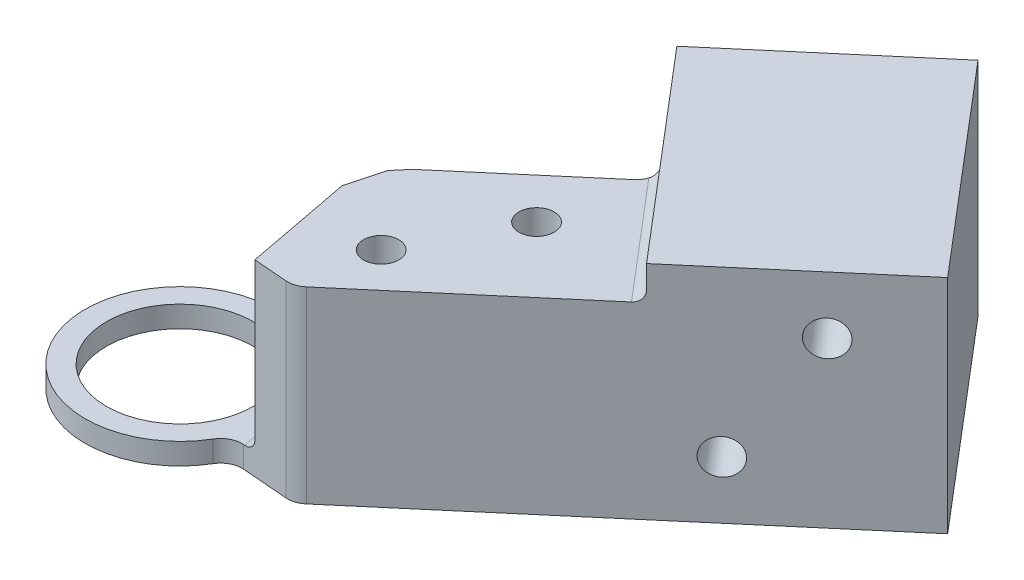
ISO-10303-21;
HEADER;
FILE_DESCRIPTION(('STEP AP214'),'2;1');
FILE_NAME('part.step','',(''),(''),'','','');
FILE_SCHEMA(('AUTOMOTIVE_DESIGN { 1 0 10303 214 1 1 1 1 }'));
ENDSEC;
DATA;
#1=APPLICATION_CONTEXT('core data for automotive mechanical design processes');
#2=APPLICATION_PROTOCOL_DEFINITION('international standard','automotive_design',2000,#1);
#3=PRODUCT_CONTEXT('',#1,'mechanical');
#4=PRODUCT('Part','Part','',(#3));
#5=PRODUCT_RELATED_PRODUCT_CATEGORY('part','',(#4));
#6=PRODUCT_DEFINITION_FORMATION('','',#4);
#7=PRODUCT_DEFINITION_CONTEXT('part definition',#1,'design');
#8=PRODUCT_DEFINITION('design','',#6,#7);
#9=PRODUCT_DEFINITION_SHAPE('','',#8);
#10=(LENGTH_UNIT() NAMED_UNIT(*) SI_UNIT(.MILLI.,.METRE.));
#11=(NAMED_UNIT(*) PLANE_ANGLE_UNIT() SI_UNIT($,.RADIAN.));
#12=(NAMED_UNIT(*) SI_UNIT($,.STERADIAN.) SOLID_ANGLE_UNIT());
#13=UNCERTAINTY_MEASURE_WITH_UNIT(LENGTH_MEASURE(1.E-05),#10,'distance_accuracy_value','');
#14=(GEOMETRIC_REPRESENTATION_CONTEXT(3) GLOBAL_UNCERTAINTY_ASSIGNED_CONTEXT((#13)) GLOBAL_UNIT_ASSIGNED_CONTEXT((#10,
#11,#12)) REPRESENTATION_CONTEXT('',''));
#15=CARTESIAN_POINT('',(0.,0.,0.));
#16=DIRECTION('',(0.,0.,1.));
#17=DIRECTION('',(1.,0.,0.));
#18=AXIS2_PLACEMENT_3D('',#15,#16,#17);
#19=CARTESIAN_POINT('',(0.,17.6,0.));
#20=DIRECTION('',(0.,1.,0.));
#21=DIRECTION('',(0.,0.,1.));
#22=AXIS2_PLACEMENT_3D('',#19,#20,#21);
#23=PLANE('',#22);
#24=DIRECTION('',(-0.99676937750449,0.,-0.0803169226832707));
#25=VECTOR('',#24,1.);
#26=CARTESIAN_POINT('',(8.18209748130973,17.6,3.43786355260721));
#27=LINE('',#26,#25);
#28=CARTESIAN_POINT('',(13.8117147150822,17.6,3.89148255646678));
#29=VERTEX_POINT('',#28);
#30=CARTESIAN_POINT('',(10.6614321873135,17.6,3.63764149360556));
#31=VERTEX_POINT('',#30);
#32=EDGE_CURVE('E193',#29,#31,#27,.T.);
#33=ORIENTED_EDGE('',*,*,#32,.F.);
#34=CARTESIAN_POINT('',(13.9723485604487,17.6,1.8979438014578));
#35=DIRECTION('',(0.,1.,0.));
#36=DIRECTION('',(0.,0.,1.));
#37=AXIS2_PLACEMENT_3D('',#34,#35,#36);
#38=CIRCLE('',#37,2.);
#39=CARTESIAN_POINT('',(15.268408051327,17.6,3.42117385502958));
#40=VERTEX_POINT('',#39);
#41=EDGE_CURVE('E62',#29,#40,#38,.T.);
#42=ORIENTED_EDGE('',*,*,#41,.T.);
#43=DIRECTION('',(0.761615026785892,0.,-0.648029745439146));
#44=VECTOR('',#43,1.);
#45=CARTESIAN_POINT('',(8.10037181798933,17.6,9.52018783482365));
#46=LINE('',#45,#44);
#47=CARTESIAN_POINT('',(31.710437648352,17.6,-10.5687342737899));
#48=VERTEX_POINT('',#47);
#49=EDGE_CURVE('E304',#40,#48,#46,.T.);
#50=ORIENTED_EDGE('',*,*,#49,.T.);
#51=DIRECTION('',(-0.648029745439148,0.,-0.761615026785891));
#52=VECTOR('',#51,1.);
#53=CARTESIAN_POINT('',(22.6380212122039,17.6,-21.2313446487924));
#54=LINE('',#53,#52);
#55=CARTESIAN_POINT('',(22.4643821652422,17.6,-21.4354187801631));
#56=VERTEX_POINT('',#55);
#57=EDGE_CURVE('E322',#48,#56,#54,.T.);
#58=ORIENTED_EDGE('',*,*,#57,.T.);
#59=CARTESIAN_POINT('',(20.5803466945397,17.6,-22.106544956925));
#60=DIRECTION('',(0.,1.,0.));
#61=DIRECTION('',(0.,0.,1.));
#62=AXIS2_PLACEMENT_3D('',#59,#60,#61);
#63=CIRCLE('',#62,2.);
#64=CARTESIAN_POINT('',(21.876406185418,17.6,-20.5833149033532));
#65=VERTEX_POINT('',#64);
#66=EDGE_CURVE('E355',#56,#65,#63,.F.);
#67=ORIENTED_EDGE('',*,*,#66,.T.);
#68=DIRECTION('',(-0.761615026785892,0.,0.648029745439147));
#69=VECTOR('',#68,1.);
#70=CARTESIAN_POINT('',(-0.972044618158711,17.6,-1.14242254017883));
#71=LINE('',#70,#69);
#72=CARTESIAN_POINT('',(10.71766515601,17.6,-11.0887594463461));
#73=VERTEX_POINT('',#72);
#74=EDGE_CURVE('E300',#65,#73,#71,.T.);
#75=ORIENTED_EDGE('',*,*,#74,.T.);
#76=DIRECTION('',(-0.646374370111485,0.,0.763020428077113));
#77=VECTOR('',#76,1.);
#78=CARTESIAN_POINT('',(10.71766515601,17.6,-11.0887594463461));
#79=LINE('',#78,#77);
#80=CARTESIAN_POINT('',(9.64280142211495,17.6,-9.81992357616805));
#81=VERTEX_POINT('',#80);
#82=EDGE_CURVE('E224',#73,#81,#79,.T.);
#83=ORIENTED_EDGE('',*,*,#82,.T.);
#84=DIRECTION('',(0.258089168484607,0.,-0.966121100644699));
#85=VECTOR('',#84,1.);
#86=CARTESIAN_POINT('',(8.02946985117542,17.6,-3.78064001315452));
#87=LINE('',#86,#85);
#88=CARTESIAN_POINT('',(8.73821595766161,17.6,-6.43373302165448));
#89=VERTEX_POINT('',#88);
#90=EDGE_CURVE('E218',#89,#81,#87,.T.);
#91=ORIENTED_EDGE('',*,*,#90,.F.);
#92=DIRECTION('',(-0.187569406552957,0.,-0.982251351602721));
#93=VECTOR('',#92,1.);
#94=CARTESIAN_POINT('',(8.73821595766161,17.6,-6.43373302165448));
#95=LINE('',#94,#93);
#96=EDGE_CURVE('E210',#31,#89,#95,.T.);
#97=ORIENTED_EDGE('',*,*,#96,.F.);
#98=EDGE_LOOP('',(#33,#42,#50,#58,#67,#75,#83,#91,#97));
#99=FACE_BOUND('',#98,.T.);
#100=CARTESIAN_POINT('',(20.7850198838034,17.6,-12.6071628377436));
#101=DIRECTION('',(0.,1.,0.));
#102=DIRECTION('',(0.,0.,1.));
#103=AXIS2_PLACEMENT_3D('',#100,#101,#102);
#104=CIRCLE('',#103,1.64999999999999);
#105=CARTESIAN_POINT('',(20.7850198838034,17.6,-10.9571628377436));
#106=VERTEX_POINT('',#105);
#107=EDGE_CURVE('E237',#106,#106,#104,.T.);
#108=ORIENTED_EDGE('',*,*,#107,.F.);
#109=EDGE_LOOP('',(#108));
#110=FACE_BOUND('',#109,.T.);
#111=CARTESIAN_POINT('',(15.7609885977011,17.6,-3.08040527620853));
#112=DIRECTION('',(0.,1.,0.));
#113=DIRECTION('',(0.,0.,1.));
#114=AXIS2_PLACEMENT_3D('',#111,#112,#113);
#115=CIRCLE('',#114,1.64999999999999);
#116=CARTESIAN_POINT('',(15.7609885977011,17.6,-1.43040527620854));
#117=VERTEX_POINT('',#116);
#118=EDGE_CURVE('E243',#117,#117,#115,.T.);
#119=ORIENTED_EDGE('',*,*,#118,.F.);
#120=EDGE_LOOP('',(#119));
#121=FACE_BOUND('',#120,.T.);
#122=ADVANCED_FACE('F39',(#99,#110,#121),#23,.T.);
#123=CARTESIAN_POINT('',(0.,-33.2,0.));
#124=DIRECTION('',(0.,1.,0.));
#125=DIRECTION('',(0.,0.,1.));
#126=AXIS2_PLACEMENT_3D('',#123,#124,#125);
#127=CYLINDRICAL_SURFACE('',#126,6.875);
#128=CARTESIAN_POINT('',(0.,0.,0.));
#129=DIRECTION('',(0.,1.,0.));
#130=DIRECTION('',(0.,0.,1.));
#131=AXIS2_PLACEMENT_3D('',#128,#129,#130);
#132=CIRCLE('',#131,6.875);
#133=CARTESIAN_POINT('',(0.,0.,6.875));
#134=VERTEX_POINT('',#133);
#135=EDGE_CURVE('E319',#134,#134,#132,.T.);
#136=ORIENTED_EDGE('',*,*,#135,.F.);
#137=EDGE_LOOP('',(#136));
#138=FACE_BOUND('',#137,.T.);
#139=CARTESIAN_POINT('',(0.,2.,0.));
#140=DIRECTION('',(0.,1.,0.));
#141=DIRECTION('',(0.,0.,1.));
#142=AXIS2_PLACEMENT_3D('',#139,#140,#141);
#143=CIRCLE('',#142,6.875);
#144=CARTESIAN_POINT('',(0.,2.,6.875));
#145=VERTEX_POINT('',#144);
#146=EDGE_CURVE('E318',#145,#145,#143,.F.);
#147=ORIENTED_EDGE('',*,*,#146,.F.);
#148=EDGE_LOOP('',(#147));
#149=FACE_BOUND('',#148,.T.);
#150=ADVANCED_FACE('F496',(#138,#149),#127,.F.);
#151=CARTESIAN_POINT('',(0.,0.,0.));
#152=DIRECTION('',(0.,1.,0.));
#153=DIRECTION('',(0.,0.,1.));
#154=AXIS2_PLACEMENT_3D('',#151,#152,#153);
#155=PLANE('',#154);
#156=DIRECTION('',(0.761615026785892,0.,-0.648029745439146));
#157=VECTOR('',#156,1.);
#158=CARTESIAN_POINT('',(8.10037181798933,0.,9.52018783482365));
#159=LINE('',#158,#157);
#160=CARTESIAN_POINT('',(15.268408051327,0.,3.42117385502958));
#161=VERTEX_POINT('',#160);
#162=CARTESIAN_POINT('',(47.7043532108557,0.,-24.177358928012));
#163=VERTEX_POINT('',#162);
#164=EDGE_CURVE('E303',#161,#163,#159,.T.);
#165=ORIENTED_EDGE('',*,*,#164,.F.);
#166=CARTESIAN_POINT('',(13.9723485604487,0.,1.8979438014578));
#167=DIRECTION('',(0.,1.,0.));
#168=DIRECTION('',(0.,0.,1.));
#169=AXIS2_PLACEMENT_3D('',#166,#167,#168);
#170=CIRCLE('',#169,2.);
#171=CARTESIAN_POINT('',(13.8117147150822,0.,3.89148255646678));
#172=VERTEX_POINT('',#171);
#173=EDGE_CURVE('E412',#161,#172,#170,.F.);
#174=ORIENTED_EDGE('',*,*,#173,.T.);
#175=DIRECTION('',(-0.99676937750449,0.,-0.0803169226832707));
#176=VECTOR('',#175,1.);
#177=CARTESIAN_POINT('',(8.18209748130973,0.,3.43786355260721));
#178=LINE('',#177,#176);
#179=CARTESIAN_POINT('',(9.51923909909447,0.,3.54560673007226));
#180=VERTEX_POINT('',#179);
#181=EDGE_CURVE('E202',#172,#180,#178,.T.);
#182=ORIENTED_EDGE('',*,*,#181,.T.);
#183=CARTESIAN_POINT('',(9.35860525372793,0.,5.53914548508124));
#184=DIRECTION('',(0.,1.,0.));
#185=DIRECTION('',(0.,0.,1.));
#186=AXIS2_PLACEMENT_3D('',#183,#184,#185);
#187=CIRCLE('',#186,2.);
#188=CARTESIAN_POINT('',(7.63748244844464,0.,4.52045206253757));
#189=VERTEX_POINT('',#188);
#190=EDGE_CURVE('E12',#180,#189,#187,.T.);
#191=ORIENTED_EDGE('',*,*,#190,.T.);
#192=CARTESIAN_POINT('',(0.,0.,0.));
#193=DIRECTION('',(0.,1.,0.));
#194=DIRECTION('',(0.,0.,1.));
#195=AXIS2_PLACEMENT_3D('',#192,#193,#194);
#196=CIRCLE('',#195,8.875);
#197=CARTESIAN_POINT('',(6.71710964302447,0.,-5.80052265262258));
#198=VERTEX_POINT('',#197);
#199=EDGE_CURVE('E311',#189,#198,#196,.F.);
#200=ORIENTED_EDGE('',*,*,#199,.T.);
#201=CARTESIAN_POINT('',(7.47396706759061,0.,-6.45410266981949));
#202=DIRECTION('',(0.,1.,0.));
#203=DIRECTION('',(0.,0.,1.));
#204=AXIS2_PLACEMENT_3D('',#201,#202,#203);
#205=CIRCLE('',#204,1.);
#206=CARTESIAN_POINT('',(8.04754350394165,0.,-5.6349506255305));
#207=VERTEX_POINT('',#206);
#208=EDGE_CURVE('E339',#198,#207,#205,.T.);
#209=ORIENTED_EDGE('',*,*,#208,.T.);
#210=DIRECTION('',(0.819152044288993,0.,-0.573576436351044));
#211=VECTOR('',#210,1.);
#212=CARTESIAN_POINT('',(0.,0.,0.));
#213=LINE('',#212,#211);
#214=CARTESIAN_POINT('',(8.33615215843007,0.,-5.83703658099585));
#215=VERTEX_POINT('',#214);
#216=EDGE_CURVE('E313',#207,#215,#213,.T.);
#217=ORIENTED_EDGE('',*,*,#216,.T.);
#218=CARTESIAN_POINT('',(7.76257572207902,0.,-6.65618862528484));
#219=DIRECTION('',(0.,1.,0.));
#220=DIRECTION('',(0.,0.,1.));
#221=AXIS2_PLACEMENT_3D('',#218,#219,#220);
#222=CIRCLE('',#221,1.);
#223=CARTESIAN_POINT('',(8.72869682272372,0.,-6.39809945680023));
#224=VERTEX_POINT('',#223);
#225=EDGE_CURVE('E441',#215,#224,#222,.T.);
#226=ORIENTED_EDGE('',*,*,#225,.T.);
#227=DIRECTION('',(-0.258089168484612,0.,0.966121100644697));
#228=VECTOR('',#227,1.);
#229=CARTESIAN_POINT('',(8.63464961695468,0.,-6.04604675159122));
#230=LINE('',#229,#228);
#231=CARTESIAN_POINT('',(9.64280142211495,0.,-9.81992357616805));
#232=VERTEX_POINT('',#231);
#233=EDGE_CURVE('E229',#232,#224,#230,.T.);
#234=ORIENTED_EDGE('',*,*,#233,.F.);
#235=DIRECTION('',(-0.646374370111485,0.,0.763020428077113));
#236=VECTOR('',#235,1.);
#237=CARTESIAN_POINT('',(10.71766515601,0.,-11.0887594463461));
#238=LINE('',#237,#236);
#239=CARTESIAN_POINT('',(10.71766515601,0.,-11.0887594463461));
#240=VERTEX_POINT('',#239);
#241=EDGE_CURVE('E226',#240,#232,#238,.T.);
#242=ORIENTED_EDGE('',*,*,#241,.F.);
#243=DIRECTION('',(-0.761615026785892,0.,0.648029745439147));
#244=VECTOR('',#243,1.);
#245=CARTESIAN_POINT('',(-0.972044618158711,0.,-1.14242254017883));
#246=LINE('',#245,#244);
#247=CARTESIAN_POINT('',(21.876406185418,0.,-20.5833149033532));
#248=VERTEX_POINT('',#247);
#249=EDGE_CURVE('E301',#248,#240,#246,.T.);
#250=ORIENTED_EDGE('',*,*,#249,.F.);
#251=CARTESIAN_POINT('',(20.5803466945397,0.,-22.106544956925));
#252=DIRECTION('',(0.,1.,0.));
#253=DIRECTION('',(0.,0.,1.));
#254=AXIS2_PLACEMENT_3D('',#251,#252,#253);
#255=CIRCLE('',#254,2.);
#256=CARTESIAN_POINT('',(22.1035767481115,0.,-23.4026044478033));
#257=VERTEX_POINT('',#256);
#258=EDGE_CURVE('E445',#248,#257,#255,.T.);
#259=ORIENTED_EDGE('',*,*,#258,.T.);
#260=DIRECTION('',(-0.648029745439148,0.,-0.761615026785891));
#261=VECTOR('',#260,1.);
#262=CARTESIAN_POINT('',(32.4720526751379,0.,-11.2167640192291));
#263=LINE('',#262,#261);
#264=CARTESIAN_POINT('',(16.2713090391592,0.,-30.2571396888764));
#265=VERTEX_POINT('',#264);
#266=EDGE_CURVE('E287',#257,#265,#263,.T.);
#267=ORIENTED_EDGE('',*,*,#266,.T.);
#268=DIRECTION('',(-0.761615026785891,0.,0.648029745439148));
#269=VECTOR('',#268,1.);
#270=CARTESIAN_POINT('',(31.503609574877,0.,-43.2177345976593));
#271=LINE('',#270,#269);
#272=CARTESIAN_POINT('',(31.503609574877,0.,-43.2177345976593));
#273=VERTEX_POINT('',#272);
#274=EDGE_CURVE('E297',#273,#265,#271,.T.);
#275=ORIENTED_EDGE('',*,*,#274,.F.);
#276=DIRECTION('',(-0.648029745439148,0.,-0.761615026785891));
#277=VECTOR('',#276,1.);
#278=CARTESIAN_POINT('',(47.7043532108557,0.,-24.177358928012));
#279=LINE('',#278,#277);
#280=EDGE_CURVE('E277',#163,#273,#279,.T.);
#281=ORIENTED_EDGE('',*,*,#280,.F.);
#282=EDGE_LOOP('',(#165,#174,#182,#191,#200,#209,#217,#226,#234,#242,#250,#259,#267,#275,#281));
#283=FACE_BOUND('',#282,.T.);
#284=ORIENTED_EDGE('',*,*,#135,.T.);
#285=EDGE_LOOP('',(#284));
#286=FACE_BOUND('',#285,.T.);
#287=ADVANCED_FACE('F368',(#283,#286),#155,.F.);
#288=CARTESIAN_POINT('',(0.,2.,0.));
#289=DIRECTION('',(0.,1.,0.));
#290=DIRECTION('',(0.,0.,1.));
#291=AXIS2_PLACEMENT_3D('',#288,#289,#290);
#292=PLANE('',#291);
#293=DIRECTION('',(-0.99676937750449,0.,-0.0803169226832708));
#294=VECTOR('',#293,1.);
#295=CARTESIAN_POINT('',(10.6614321873135,2.,3.63764149360556));
#296=LINE('',#295,#294);
#297=CARTESIAN_POINT('',(9.62745307672707,2.,3.55432631342918));
#298=VERTEX_POINT('',#297);
#299=CARTESIAN_POINT('',(9.51923909909447,2.,3.54560673007226));
#300=VERTEX_POINT('',#299);
#301=EDGE_CURVE('E203',#298,#300,#296,.T.);
#302=ORIENTED_EDGE('',*,*,#301,.F.);
#303=DIRECTION('',(0.187569406552957,0.,0.982251351602721));
#304=VECTOR('',#303,1.);
#305=CARTESIAN_POINT('',(8.63388714767223,2.,-1.64871556133942));
#306=LINE('',#305,#304);
#307=CARTESIAN_POINT('',(7.88991264770524,2.,-5.54471316340153));
#308=VERTEX_POINT('',#307);
#309=EDGE_CURVE('E448',#298,#308,#306,.F.);
#310=ORIENTED_EDGE('',*,*,#309,.T.);
#311=CARTESIAN_POINT('',(7.47396706759061,2.,-6.45410266981949));
#312=DIRECTION('',(0.,1.,0.));
#313=DIRECTION('',(0.,0.,1.));
#314=AXIS2_PLACEMENT_3D('',#311,#312,#313);
#315=CIRCLE('',#314,1.);
#316=CARTESIAN_POINT('',(6.71710964302447,2.,-5.80052265262258));
#317=VERTEX_POINT('',#316);
#318=EDGE_CURVE('E336',#308,#317,#315,.F.);
#319=ORIENTED_EDGE('',*,*,#318,.T.);
#320=CARTESIAN_POINT('',(0.,2.,0.));
#321=DIRECTION('',(0.,1.,0.));
#322=DIRECTION('',(0.,0.,1.));
#323=AXIS2_PLACEMENT_3D('',#320,#321,#322);
#324=CIRCLE('',#323,8.875);
#325=CARTESIAN_POINT('',(7.63748244844464,2.,4.52045206253757));
#326=VERTEX_POINT('',#325);
#327=EDGE_CURVE('E316',#326,#317,#324,.F.);
#328=ORIENTED_EDGE('',*,*,#327,.F.);
#329=CARTESIAN_POINT('',(9.35860525372793,2.,5.53914548508124));
#330=DIRECTION('',(0.,1.,0.));
#331=DIRECTION('',(0.,0.,1.));
#332=AXIS2_PLACEMENT_3D('',#329,#330,#331);
#333=CIRCLE('',#332,2.);
#334=EDGE_CURVE('E47',#326,#300,#333,.F.);
#335=ORIENTED_EDGE('',*,*,#334,.T.);
#336=EDGE_LOOP('',(#302,#310,#319,#328,#335));
#337=FACE_BOUND('',#336,.T.);
#338=ORIENTED_EDGE('',*,*,#146,.T.);
#339=EDGE_LOOP('',(#338));
#340=FACE_BOUND('',#339,.T.);
#341=ADVANCED_FACE('F416',(#337,#340),#292,.T.);
#342=CARTESIAN_POINT('',(0.,0.,0.));
#343=DIRECTION('',(0.573576436351044,0.,0.819152044288993));
#344=DIRECTION('',(0.819152044288993,0.,-0.573576436351044));
#345=AXIS2_PLACEMENT_3D('',#342,#343,#344);
#346=PLANE('',#345);
#347=DIRECTION('',(0.,-1.,0.));
#348=VECTOR('',#347,1.);
#349=CARTESIAN_POINT('',(8.04754350394165,2.,-5.6349506255305));
#350=LINE('',#349,#348);
#351=CARTESIAN_POINT('',(8.04754350394165,2.01486098582819,-5.6349506255305));
#352=VERTEX_POINT('',#351);
#353=EDGE_CURVE('E334',#207,#352,#350,.F.);
#354=ORIENTED_EDGE('',*,*,#353,.T.);
#355=CARTESIAN_POINT('',(7.89330443567853,3.,-5.52695126724622));
#356=DIRECTION('',(0.573576436351044,0.,0.819152044288993));
#357=DIRECTION('',(-0.819152044288993,0.,0.573576436351044));
#358=AXIS2_PLACEMENT_3D('',#355,#356,#357);
#359=ELLIPSE('',#358,1.09625251133259,1.);
#360=CARTESIAN_POINT('',(8.33615215843007,2.130055870185,-5.83703658099585));
#361=VERTEX_POINT('',#360);
#362=EDGE_CURVE('E383',#352,#361,#359,.T.);
#363=ORIENTED_EDGE('',*,*,#362,.T.);
#364=DIRECTION('',(0.,1.,0.));
#365=VECTOR('',#364,1.);
#366=CARTESIAN_POINT('',(8.33615215843007,0.,-5.83703658099585));
#367=LINE('',#366,#365);
#368=EDGE_CURVE('E437',#361,#215,#367,.F.);
#369=ORIENTED_EDGE('',*,*,#368,.T.);
#370=ORIENTED_EDGE('',*,*,#216,.F.);
#371=EDGE_LOOP('',(#354,#363,#369,#370));
#372=FACE_BOUND('',#371,.T.);
#373=ADVANCED_FACE('F435',(#372),#346,.F.);
#374=CARTESIAN_POINT('',(0.,0.,0.));
#375=DIRECTION('',(0.,1.,0.));
#376=DIRECTION('',(0.,0.,1.));
#377=AXIS2_PLACEMENT_3D('',#374,#375,#376);
#378=CYLINDRICAL_SURFACE('',#377,8.875);
#379=ORIENTED_EDGE('',*,*,#199,.F.);
#380=DIRECTION('',(0.,1.,0.));
#381=VECTOR('',#380,1.);
#382=CARTESIAN_POINT('',(7.63748244844464,0.,4.52045206253757));
#383=LINE('',#382,#381);
#384=EDGE_CURVE('E404',#189,#326,#383,.T.);
#385=ORIENTED_EDGE('',*,*,#384,.T.);
#386=ORIENTED_EDGE('',*,*,#327,.T.);
#387=DIRECTION('',(0.,1.,0.));
#388=VECTOR('',#387,1.);
#389=CARTESIAN_POINT('',(6.71710964302447,0.,-5.80052265262258));
#390=LINE('',#389,#388);
#391=EDGE_CURVE('E331',#317,#198,#390,.F.);
#392=ORIENTED_EDGE('',*,*,#391,.T.);
#393=EDGE_LOOP('',(#379,#385,#386,#392));
#394=FACE_BOUND('',#393,.T.);
#395=ADVANCED_FACE('F427',(#394),#378,.T.);
#396=CARTESIAN_POINT('',(-0.972044618158711,0.,-1.14242254017883));
#397=DIRECTION('',(-0.648029745439147,0.,-0.761615026785892));
#398=DIRECTION('',(-0.761615026785892,0.,0.648029745439147));
#399=AXIS2_PLACEMENT_3D('',#396,#397,#398);
#400=PLANE('',#399);
#401=ORIENTED_EDGE('',*,*,#74,.F.);
#402=DIRECTION('',(0.,1.,0.));
#403=VECTOR('',#402,1.);
#404=CARTESIAN_POINT('',(21.876406185418,0.,-20.5833149033532));
#405=LINE('',#404,#403);
#406=EDGE_CURVE('E344',#65,#248,#405,.F.);
#407=ORIENTED_EDGE('',*,*,#406,.T.);
#408=ORIENTED_EDGE('',*,*,#249,.T.);
#409=DIRECTION('',(0.,1.,0.));
#410=VECTOR('',#409,1.);
#411=CARTESIAN_POINT('',(10.71766515601,0.,-11.0887594463461));
#412=LINE('',#411,#410);
#413=EDGE_CURVE('E306',#240,#73,#412,.T.);
#414=ORIENTED_EDGE('',*,*,#413,.T.);
#415=EDGE_LOOP('',(#401,#407,#408,#414));
#416=FACE_BOUND('',#415,.T.);
#417=ADVANCED_FACE('F464',(#416),#400,.T.);
#418=CARTESIAN_POINT('',(8.10037181798933,0.,9.52018783482365));
#419=DIRECTION('',(0.648029745439147,0.,0.761615026785892));
#420=DIRECTION('',(0.761615026785892,0.,-0.648029745439147));
#421=AXIS2_PLACEMENT_3D('',#418,#419,#420);
#422=PLANE('',#421);
#423=ORIENTED_EDGE('',*,*,#49,.F.);
#424=DIRECTION('',(0.,1.,0.));
#425=VECTOR('',#424,1.);
#426=CARTESIAN_POINT('',(15.268408051327,0.,3.42117385502958));
#427=LINE('',#426,#425);
#428=EDGE_CURVE('E54',#40,#161,#427,.F.);
#429=ORIENTED_EDGE('',*,*,#428,.T.);
#430=ORIENTED_EDGE('',*,*,#164,.T.);
#431=DIRECTION('',(0.,-1.,0.));
#432=VECTOR('',#431,1.);
#433=CARTESIAN_POINT('',(47.7043532108557,0.,-24.177358928012));
#434=LINE('',#433,#432);
#435=CARTESIAN_POINT('',(47.7043532108557,20.775,-24.177358928012));
#436=VERTEX_POINT('',#435);
#437=EDGE_CURVE('E274',#436,#163,#434,.T.);
#438=ORIENTED_EDGE('',*,*,#437,.F.);
#439=DIRECTION('',(-0.761615026785891,0.,0.648029745439148));
#440=VECTOR('',#439,1.);
#441=CARTESIAN_POINT('',(47.7043532108557,20.775,-24.177358928012));
#442=LINE('',#441,#440);
#443=CARTESIAN_POINT('',(32.4720526751379,20.775,-11.2167640192291));
#444=VERTEX_POINT('',#443);
#445=EDGE_CURVE('E284',#436,#444,#442,.T.);
#446=ORIENTED_EDGE('',*,*,#445,.T.);
#447=DIRECTION('',(0.,-1.,0.));
#448=VECTOR('',#447,1.);
#449=CARTESIAN_POINT('',(32.4720526751379,0.,-11.2167640192291));
#450=LINE('',#449,#448);
#451=CARTESIAN_POINT('',(32.4720526751379,18.6,-11.2167640192291));
#452=VERTEX_POINT('',#451);
#453=EDGE_CURVE('E273',#444,#452,#450,.T.);
#454=ORIENTED_EDGE('',*,*,#453,.T.);
#455=CARTESIAN_POINT('',(31.710437648352,18.6,-10.5687342737899));
#456=DIRECTION('',(0.648029745439147,0.,0.761615026785892));
#457=DIRECTION('',(0.761615026785892,0.,-0.648029745439147));
#458=AXIS2_PLACEMENT_3D('',#455,#456,#457);
#459=CIRCLE('',#458,1.);
#460=EDGE_CURVE('E328',#452,#48,#459,.F.);
#461=ORIENTED_EDGE('',*,*,#460,.T.);
#462=EDGE_LOOP('',(#423,#429,#430,#438,#446,#454,#461));
#463=FACE_BOUND('',#462,.T.);
#464=CARTESIAN_POINT('',(41.6114329965686,15.3875,-18.9931209644988));
#465=DIRECTION('',(0.648029745439147,0.,0.761615026785892));
#466=DIRECTION('',(0.761615026785892,0.,-0.648029745439147));
#467=AXIS2_PLACEMENT_3D('',#464,#465,#466);
#468=CIRCLE('',#467,1.64999999999999);
#469=CARTESIAN_POINT('',(42.8680977907653,15.3875,-20.0623700444734));
#470=VERTEX_POINT('',#469);
#471=EDGE_CURVE('E249',#470,#470,#468,.T.);
#472=ORIENTED_EDGE('',*,*,#471,.F.);
#473=EDGE_LOOP('',(#472));
#474=FACE_BOUND('',#473,.T.);
#475=CARTESIAN_POINT('',(36.2801278090673,5.38749999999999,-14.4569127464248));
#476=DIRECTION('',(0.648029745439147,0.,0.761615026785892));
#477=DIRECTION('',(0.761615026785892,0.,-0.648029745439147));
#478=AXIS2_PLACEMENT_3D('',#475,#476,#477);
#479=CIRCLE('',#478,1.64999999999999);
#480=CARTESIAN_POINT('',(37.536792603264,5.38749999999999,-15.5261618263994));
#481=VERTEX_POINT('',#480);
#482=EDGE_CURVE('E255',#481,#481,#479,.T.);
#483=ORIENTED_EDGE('',*,*,#482,.F.);
#484=EDGE_LOOP('',(#483));
#485=FACE_BOUND('',#484,.T.);
#486=ADVANCED_FACE('F511',(#463,#474,#485),#422,.T.);
#487=CARTESIAN_POINT('',(24.3716808571485,0.,-20.7369518540527));
#488=DIRECTION('',(-0.761615026785891,0.,0.648029745439148));
#489=DIRECTION('',(0.648029745439148,0.,0.761615026785891));
#490=AXIS2_PLACEMENT_3D('',#487,#488,#489);
#491=PLANE('',#490);
#492=ORIENTED_EDGE('',*,*,#266,.F.);
#493=DIRECTION('',(0.,1.,0.));
#494=VECTOR('',#493,1.);
#495=CARTESIAN_POINT('',(22.1035767481115,18.6,-23.4026044478033));
#496=LINE('',#495,#494);
#497=CARTESIAN_POINT('',(22.1035767481115,18.6,-23.4026044478033));
#498=VERTEX_POINT('',#497);
#499=EDGE_CURVE('E341',#257,#498,#496,.T.);
#500=ORIENTED_EDGE('',*,*,#499,.T.);
#501=DIRECTION('',(-0.648029745439148,0.,-0.761615026785891));
#502=VECTOR('',#501,1.);
#503=CARTESIAN_POINT('',(32.4720526751379,18.6,-11.216764019229));
#504=LINE('',#503,#502);
#505=EDGE_CURVE('E326',#498,#452,#504,.F.);
#506=ORIENTED_EDGE('',*,*,#505,.T.);
#507=ORIENTED_EDGE('',*,*,#453,.F.);
#508=DIRECTION('',(0.648029745439148,0.,0.761615026785891));
#509=VECTOR('',#508,1.);
#510=CARTESIAN_POINT('',(32.4720526751379,20.775,-11.2167640192291));
#511=LINE('',#510,#509);
#512=CARTESIAN_POINT('',(16.2713090391592,20.775,-30.2571396888764));
#513=VERTEX_POINT('',#512);
#514=EDGE_CURVE('E278',#513,#444,#511,.T.);
#515=ORIENTED_EDGE('',*,*,#514,.F.);
#516=DIRECTION('',(0.,1.,0.));
#517=VECTOR('',#516,1.);
#518=CARTESIAN_POINT('',(16.2713090391592,0.,-30.2571396888764));
#519=LINE('',#518,#517);
#520=EDGE_CURVE('E289',#265,#513,#519,.T.);
#521=ORIENTED_EDGE('',*,*,#520,.F.);
#522=EDGE_LOOP('',(#492,#500,#506,#507,#515,#521));
#523=FACE_BOUND('',#522,.T.);
#524=ADVANCED_FACE('F474',(#523),#491,.T.);
#525=CARTESIAN_POINT('',(31.503609574877,0.,-43.2177345976593));
#526=DIRECTION('',(0.648029745439148,0.,0.761615026785891));
#527=DIRECTION('',(0.761615026785891,0.,-0.648029745439148));
#528=AXIS2_PLACEMENT_3D('',#525,#526,#527);
#529=PLANE('',#528);
#530=CARTESIAN_POINT('',(25.4106893605899,15.3875,-38.0334966341461));
#531=DIRECTION('',(-0.648029745439146,0.,-0.761615026785892));
#532=DIRECTION('',(-0.761615026785892,0.,0.648029745439146));
#533=AXIS2_PLACEMENT_3D('',#530,#531,#532);
#534=CIRCLE('',#533,1.64999999999999);
#535=CARTESIAN_POINT('',(24.1540245663932,15.3875,-36.9642475541715));
#536=VERTEX_POINT('',#535);
#537=EDGE_CURVE('E261',#536,#536,#534,.T.);
#538=ORIENTED_EDGE('',*,*,#537,.F.);
#539=EDGE_LOOP('',(#538));
#540=FACE_BOUND('',#539,.T.);
#541=CARTESIAN_POINT('',(20.0793841730887,5.3875,-33.497288416072));
#542=DIRECTION('',(-0.648029745439146,0.,-0.761615026785892));
#543=DIRECTION('',(-0.761615026785892,0.,0.648029745439146));
#544=AXIS2_PLACEMENT_3D('',#541,#542,#543);
#545=CIRCLE('',#544,1.64999999999999);
#546=CARTESIAN_POINT('',(18.822719378892,5.3875,-32.4280393360975));
#547=VERTEX_POINT('',#546);
#548=EDGE_CURVE('E267',#547,#547,#545,.T.);
#549=ORIENTED_EDGE('',*,*,#548,.F.);
#550=EDGE_LOOP('',(#549));
#551=FACE_BOUND('',#550,.T.);
#552=ORIENTED_EDGE('',*,*,#520,.T.);
#553=DIRECTION('',(-0.761615026785891,0.,0.648029745439148));
#554=VECTOR('',#553,1.);
#555=CARTESIAN_POINT('',(31.503609574877,20.775,-43.2177345976593));
#556=LINE('',#555,#554);
#557=CARTESIAN_POINT('',(31.503609574877,20.775,-43.2177345976593));
#558=VERTEX_POINT('',#557);
#559=EDGE_CURVE('E294',#558,#513,#556,.T.);
#560=ORIENTED_EDGE('',*,*,#559,.F.);
#561=DIRECTION('',(0.,1.,0.));
#562=VECTOR('',#561,1.);
#563=CARTESIAN_POINT('',(31.503609574877,0.,-43.2177345976593));
#564=LINE('',#563,#562);
#565=EDGE_CURVE('E280',#273,#558,#564,.T.);
#566=ORIENTED_EDGE('',*,*,#565,.F.);
#567=ORIENTED_EDGE('',*,*,#274,.T.);
#568=EDGE_LOOP('',(#552,#560,#566,#567));
#569=FACE_BOUND('',#568,.T.);
#570=ADVANCED_FACE('F482',(#540,#551,#569),#529,.F.);
#571=CARTESIAN_POINT('',(47.7043532108557,20.775,-24.177358928012));
#572=DIRECTION('',(0.,-1.,0.));
#573=DIRECTION('',(0.,0.,-1.));
#574=AXIS2_PLACEMENT_3D('',#571,#572,#573);
#575=PLANE('',#574);
#576=ORIENTED_EDGE('',*,*,#514,.T.);
#577=ORIENTED_EDGE('',*,*,#445,.F.);
#578=DIRECTION('',(0.648029745439148,0.,0.761615026785891));
#579=VECTOR('',#578,1.);
#580=CARTESIAN_POINT('',(47.7043532108557,20.775,-24.177358928012));
#581=LINE('',#580,#579);
#582=EDGE_CURVE('E282',#558,#436,#581,.T.);
#583=ORIENTED_EDGE('',*,*,#582,.F.);
#584=ORIENTED_EDGE('',*,*,#559,.T.);
#585=EDGE_LOOP('',(#576,#577,#583,#584));
#586=FACE_BOUND('',#585,.T.);
#587=ADVANCED_FACE('F516',(#586),#575,.F.);
#588=CARTESIAN_POINT('',(39.6039813928663,0.,-33.6975467628357));
#589=DIRECTION('',(-0.761615026785891,0.,0.648029745439148));
#590=DIRECTION('',(0.648029745439148,0.,0.761615026785891));
#591=AXIS2_PLACEMENT_3D('',#588,#589,#590);
#592=PLANE('',#591);
#593=ORIENTED_EDGE('',*,*,#437,.T.);
#594=ORIENTED_EDGE('',*,*,#280,.T.);
#595=ORIENTED_EDGE('',*,*,#565,.T.);
#596=ORIENTED_EDGE('',*,*,#582,.T.);
#597=EDGE_LOOP('',(#593,#594,#595,#596));
#598=FACE_BOUND('',#597,.T.);
#599=ADVANCED_FACE('F486',(#598),#592,.F.);
#600=CARTESIAN_POINT('',(24.6155923911627,5.3875,-28.1659832285708));
#601=DIRECTION('',(-0.648029745439146,0.,-0.761615026785892));
#602=DIRECTION('',(-0.761615026785892,0.,0.648029745439146));
#603=AXIS2_PLACEMENT_3D('',#600,#601,#602);
#604=CONICAL_SURFACE('',#603,1.65,1.02974425867665);
#605=CARTESIAN_POINT('',(25.2580620552509,5.3875,-27.4109028424196));
#606=VERTEX_POINT('',#605);
#607=VERTEX_LOOP('',#606);
#608=FACE_BOUND('',#607,.T.);
#609=CARTESIAN_POINT('',(24.6155923911627,5.3875,-28.1659832285708));
#610=DIRECTION('',(-0.648029745439146,0.,-0.761615026785892));
#611=DIRECTION('',(-0.761615026785892,0.,0.648029745439146));
#612=AXIS2_PLACEMENT_3D('',#609,#610,#611);
#613=CIRCLE('',#612,1.65);
#614=CARTESIAN_POINT('',(23.358927596966,5.3875,-27.0967341485962));
#615=VERTEX_POINT('',#614);
#616=EDGE_CURVE('E270',#615,#615,#613,.T.);
#617=ORIENTED_EDGE('',*,*,#616,.T.);
#618=EDGE_LOOP('',(#617));
#619=FACE_BOUND('',#618,.T.);
#620=ADVANCED_FACE('F525',(#608,#619),#604,.F.);
#621=CARTESIAN_POINT('',(20.0793841730887,5.3875,-33.497288416072));
#622=DIRECTION('',(-0.648029745439146,0.,-0.761615026785892));
#623=DIRECTION('',(-0.761615026785892,0.,0.648029745439146));
#624=AXIS2_PLACEMENT_3D('',#621,#622,#623);
#625=CYLINDRICAL_SURFACE('',#624,1.64999999999999);
#626=ORIENTED_EDGE('',*,*,#616,.F.);
#627=EDGE_LOOP('',(#626));
#628=FACE_BOUND('',#627,.T.);
#629=ORIENTED_EDGE('',*,*,#548,.T.);
#630=EDGE_LOOP('',(#629));
#631=FACE_BOUND('',#630,.T.);
#632=ADVANCED_FACE('F528',(#628,#631),#625,.F.);
#633=CARTESIAN_POINT('',(29.9468975786639,15.3875,-32.7021914466448));
#634=DIRECTION('',(-0.648029745439146,0.,-0.761615026785892));
#635=DIRECTION('',(-0.761615026785892,0.,0.648029745439146));
#636=AXIS2_PLACEMENT_3D('',#633,#634,#635);
#637=CONICAL_SURFACE('',#636,1.65,1.02974425867665);
#638=CARTESIAN_POINT('',(30.5893672427521,15.3875,-31.9471110604936));
#639=VERTEX_POINT('',#638);
#640=VERTEX_LOOP('',#639);
#641=FACE_BOUND('',#640,.T.);
#642=CARTESIAN_POINT('',(29.9468975786639,15.3875,-32.7021914466448));
#643=DIRECTION('',(-0.648029745439146,0.,-0.761615026785892));
#644=DIRECTION('',(-0.761615026785892,0.,0.648029745439146));
#645=AXIS2_PLACEMENT_3D('',#642,#643,#644);
#646=CIRCLE('',#645,1.65);
#647=CARTESIAN_POINT('',(28.6902327844672,15.3875,-31.6329423666702));
#648=VERTEX_POINT('',#647);
#649=EDGE_CURVE('E264',#648,#648,#646,.T.);
#650=ORIENTED_EDGE('',*,*,#649,.T.);
#651=EDGE_LOOP('',(#650));
#652=FACE_BOUND('',#651,.T.);
#653=ADVANCED_FACE('F532',(#641,#652),#637,.F.);
#654=CARTESIAN_POINT('',(25.4106893605899,15.3875,-38.0334966341461));
#655=DIRECTION('',(-0.648029745439146,0.,-0.761615026785892));
#656=DIRECTION('',(-0.761615026785892,0.,0.648029745439146));
#657=AXIS2_PLACEMENT_3D('',#654,#655,#656);
#658=CYLINDRICAL_SURFACE('',#657,1.64999999999999);
#659=ORIENTED_EDGE('',*,*,#649,.F.);
#660=EDGE_LOOP('',(#659));
#661=FACE_BOUND('',#660,.T.);
#662=ORIENTED_EDGE('',*,*,#537,.T.);
#663=EDGE_LOOP('',(#662));
#664=FACE_BOUND('',#663,.T.);
#665=ADVANCED_FACE('F536',(#661,#664),#658,.F.);
#666=CARTESIAN_POINT('',(31.7439195909933,5.38749999999999,-19.788217933926));
#667=DIRECTION('',(0.648029745439147,0.,0.761615026785892));
#668=DIRECTION('',(0.761615026785892,0.,-0.648029745439147));
#669=AXIS2_PLACEMENT_3D('',#666,#667,#668);
#670=CONICAL_SURFACE('',#669,1.65,1.02974425867666);
#671=CARTESIAN_POINT('',(31.1014499269051,5.38749999999999,-20.5432983200772));
#672=VERTEX_POINT('',#671);
#673=VERTEX_LOOP('',#672);
#674=FACE_BOUND('',#673,.T.);
#675=CARTESIAN_POINT('',(31.7439195909933,5.38749999999999,-19.788217933926));
#676=DIRECTION('',(0.648029745439147,0.,0.761615026785892));
#677=DIRECTION('',(0.761615026785892,0.,-0.648029745439147));
#678=AXIS2_PLACEMENT_3D('',#675,#676,#677);
#679=CIRCLE('',#678,1.65);
#680=CARTESIAN_POINT('',(33.00058438519,5.38749999999999,-20.8574670139006));
#681=VERTEX_POINT('',#680);
#682=EDGE_CURVE('E258',#681,#681,#679,.T.);
#683=ORIENTED_EDGE('',*,*,#682,.T.);
#684=EDGE_LOOP('',(#683));
#685=FACE_BOUND('',#684,.T.);
#686=ADVANCED_FACE('F540',(#674,#685),#670,.F.);
#687=CARTESIAN_POINT('',(36.2801278090673,5.38749999999999,-14.4569127464248));
#688=DIRECTION('',(0.648029745439147,0.,0.761615026785892));
#689=DIRECTION('',(0.761615026785892,0.,-0.648029745439147));
#690=AXIS2_PLACEMENT_3D('',#687,#688,#689);
#691=CYLINDRICAL_SURFACE('',#690,1.64999999999999);
#692=ORIENTED_EDGE('',*,*,#682,.F.);
#693=EDGE_LOOP('',(#692));
#694=FACE_BOUND('',#693,.T.);
#695=ORIENTED_EDGE('',*,*,#482,.T.);
#696=EDGE_LOOP('',(#695));
#697=FACE_BOUND('',#696,.T.);
#698=ADVANCED_FACE('F544',(#694,#697),#691,.F.);
#699=CARTESIAN_POINT('',(37.0752247784945,15.3875,-24.3244261520001));
#700=DIRECTION('',(0.648029745439147,0.,0.761615026785892));
#701=DIRECTION('',(0.761615026785892,0.,-0.648029745439147));
#702=AXIS2_PLACEMENT_3D('',#699,#700,#701);
#703=CONICAL_SURFACE('',#702,1.65,1.02974425867665);
#704=CARTESIAN_POINT('',(36.4327551144063,15.3875,-25.0795065381512));
#705=VERTEX_POINT('',#704);
#706=VERTEX_LOOP('',#705);
#707=FACE_BOUND('',#706,.T.);
#708=CARTESIAN_POINT('',(37.0752247784945,15.3875,-24.3244261520001));
#709=DIRECTION('',(0.648029745439147,0.,0.761615026785892));
#710=DIRECTION('',(0.761615026785892,0.,-0.648029745439147));
#711=AXIS2_PLACEMENT_3D('',#708,#709,#710);
#712=CIRCLE('',#711,1.65);
#713=CARTESIAN_POINT('',(38.3318895726912,15.3875,-25.3936752319746));
#714=VERTEX_POINT('',#713);
#715=EDGE_CURVE('E252',#714,#714,#712,.T.);
#716=ORIENTED_EDGE('',*,*,#715,.T.);
#717=EDGE_LOOP('',(#716));
#718=FACE_BOUND('',#717,.T.);
#719=ADVANCED_FACE('F548',(#707,#718),#703,.F.);
#720=CARTESIAN_POINT('',(41.6114329965686,15.3875,-18.9931209644988));
#721=DIRECTION('',(0.648029745439147,0.,0.761615026785892));
#722=DIRECTION('',(0.761615026785892,0.,-0.648029745439147));
#723=AXIS2_PLACEMENT_3D('',#720,#721,#722);
#724=CYLINDRICAL_SURFACE('',#723,1.64999999999999);
#725=ORIENTED_EDGE('',*,*,#715,.F.);
#726=EDGE_LOOP('',(#725));
#727=FACE_BOUND('',#726,.T.);
#728=ORIENTED_EDGE('',*,*,#471,.T.);
#729=EDGE_LOOP('',(#728));
#730=FACE_BOUND('',#729,.T.);
#731=ADVANCED_FACE('F552',(#727,#730),#724,.F.);
#732=CARTESIAN_POINT('',(15.7609885977011,10.6,-3.08040527620853));
#733=DIRECTION('',(0.,1.,0.));
#734=DIRECTION('',(0.,0.,1.));
#735=AXIS2_PLACEMENT_3D('',#732,#733,#734);
#736=CONICAL_SURFACE('',#735,1.65,1.02974425867665);
#737=CARTESIAN_POINT('',(15.7609885977011,9.60857997860453,-3.08040527620853));
#738=VERTEX_POINT('',#737);
#739=VERTEX_LOOP('',#738);
#740=FACE_BOUND('',#739,.T.);
#741=CARTESIAN_POINT('',(15.7609885977011,10.6,-3.08040527620853));
#742=DIRECTION('',(0.,1.,0.));
#743=DIRECTION('',(0.,0.,1.));
#744=AXIS2_PLACEMENT_3D('',#741,#742,#743);
#745=CIRCLE('',#744,1.65);
#746=CARTESIAN_POINT('',(15.7609885977011,10.6,-1.43040527620853));
#747=VERTEX_POINT('',#746);
#748=EDGE_CURVE('E246',#747,#747,#745,.T.);
#749=ORIENTED_EDGE('',*,*,#748,.T.);
#750=EDGE_LOOP('',(#749));
#751=FACE_BOUND('',#750,.T.);
#752=ADVANCED_FACE('F556',(#740,#751),#736,.F.);
#753=CARTESIAN_POINT('',(15.7609885977011,17.6,-3.08040527620853));
#754=DIRECTION('',(0.,1.,0.));
#755=DIRECTION('',(0.,0.,1.));
#756=AXIS2_PLACEMENT_3D('',#753,#754,#755);
#757=CYLINDRICAL_SURFACE('',#756,1.65);
#758=ORIENTED_EDGE('',*,*,#748,.F.);
#759=EDGE_LOOP('',(#758));
#760=FACE_BOUND('',#759,.T.);
#761=ORIENTED_EDGE('',*,*,#118,.T.);
#762=EDGE_LOOP('',(#761));
#763=FACE_BOUND('',#762,.T.);
#764=ADVANCED_FACE('F560',(#760,#763),#757,.F.);
#765=CARTESIAN_POINT('',(20.7850198838034,10.6,-12.6071628377436));
#766=DIRECTION('',(0.,1.,0.));
#767=DIRECTION('',(0.,0.,1.));
#768=AXIS2_PLACEMENT_3D('',#765,#766,#767);
#769=CONICAL_SURFACE('',#768,1.65,1.02974425867665);
#770=CARTESIAN_POINT('',(20.7850198838034,9.60857997860453,-12.6071628377436));
#771=VERTEX_POINT('',#770);
#772=VERTEX_LOOP('',#771);
#773=FACE_BOUND('',#772,.T.);
#774=CARTESIAN_POINT('',(20.7850198838034,10.6,-12.6071628377436));
#775=DIRECTION('',(0.,1.,0.));
#776=DIRECTION('',(0.,0.,1.));
#777=AXIS2_PLACEMENT_3D('',#774,#775,#776);
#778=CIRCLE('',#777,1.65);
#779=CARTESIAN_POINT('',(20.7850198838034,10.6,-10.9571628377436));
#780=VERTEX_POINT('',#779);
#781=EDGE_CURVE('E240',#780,#780,#778,.T.);
#782=ORIENTED_EDGE('',*,*,#781,.T.);
#783=EDGE_LOOP('',(#782));
#784=FACE_BOUND('',#783,.T.);
#785=ADVANCED_FACE('F564',(#773,#784),#769,.F.);
#786=CARTESIAN_POINT('',(20.7850198838034,17.6,-12.6071628377436));
#787=DIRECTION('',(0.,1.,0.));
#788=DIRECTION('',(0.,0.,1.));
#789=AXIS2_PLACEMENT_3D('',#786,#787,#788);
#790=CYLINDRICAL_SURFACE('',#789,1.64999999999999);
#791=ORIENTED_EDGE('',*,*,#781,.F.);
#792=EDGE_LOOP('',(#791));
#793=FACE_BOUND('',#792,.T.);
#794=ORIENTED_EDGE('',*,*,#107,.T.);
#795=EDGE_LOOP('',(#794));
#796=FACE_BOUND('',#795,.T.);
#797=ADVANCED_FACE('F366',(#793,#796),#790,.F.);
#798=CARTESIAN_POINT('',(23.6100658303626,18.6,-20.0889221086136));
#799=DIRECTION('',(0.648029745439148,0.,0.761615026785891));
#800=DIRECTION('',(0.761615026785891,0.,-0.648029745439148));
#801=AXIS2_PLACEMENT_3D('',#798,#799,#800);
#802=CYLINDRICAL_SURFACE('',#801,1.);
#803=ORIENTED_EDGE('',*,*,#460,.F.);
#804=ORIENTED_EDGE('',*,*,#505,.F.);
#805=CARTESIAN_POINT('',(22.4643821652422,17.6,-21.4354187801631));
#806=CARTESIAN_POINT('',(22.4789067108878,17.5999998056884,-21.4761537116862));
#807=CARTESIAN_POINT('',(22.4920684607521,17.602103197962,-21.5173201481635));
#808=CARTESIAN_POINT('',(22.5156051969201,17.6100134076426,-21.5999856181927));
#809=CARTESIAN_POINT('',(22.52598715061,17.6158108403891,-21.6414835465486));
#810=CARTESIAN_POINT('',(22.5438577607726,17.6305123591962,-21.723942182586));
#811=CARTESIAN_POINT('',(22.5513829262915,17.6393742698425,-21.7649027239194));
#812=CARTESIAN_POINT('',(22.5638082144595,17.6597852158221,-21.846566433192));
#813=CARTESIAN_POINT('',(22.568706393757,17.6713362314266,-21.8872693886431));
#814=CARTESIAN_POINT('',(22.5809729498892,17.7142327675106,-22.0239732827775));
#815=CARTESIAN_POINT('',(22.5824445752691,17.7509215034251,-22.1188866660507));
#816=CARTESIAN_POINT('',(22.5727179203614,17.8331876683941,-22.304482331464));
#817=CARTESIAN_POINT('',(22.5614428475283,17.8788175882158,-22.3951355050126));
#818=CARTESIAN_POINT('',(22.5208823912814,17.9956654044556,-22.6066980698438));
#819=CARTESIAN_POINT('',(22.4861492428627,18.0697581556716,-22.7249773190207));
#820=CARTESIAN_POINT('',(22.39802732187,18.2239793949534,-22.9495067952112));
#821=CARTESIAN_POINT('',(22.3446627919287,18.3040999340624,-23.0557724173043));
#822=CARTESIAN_POINT('',(22.2306031522248,18.4546835611495,-23.240828002803));
#823=CARTESIAN_POINT('',(22.1722250153233,18.5247822523478,-23.321345141413));
#824=CARTESIAN_POINT('',(22.1067283540327,18.5965573838849,-23.3988935694775));
#825=CARTESIAN_POINT('',(22.1051542225523,18.5982787128306,-23.4007504689837));
#826=CARTESIAN_POINT('',(22.1035767481115,18.6,-23.4026044478033));
#827=B_SPLINE_CURVE_WITH_KNOTS('',3,(#805,#806,#807,#808,#809,#810,#811,#812,#813,#814,#815,
#816,#817,#818,#819,#820,#821,#822,#823,#824,#825,#826),.UNSPECIFIED.,.F.,.F.,(4,2,2,2,2,2,2,2,
2,2,4),(0.,0.129592295294571,0.25885666865275,0.3864085092684,0.514054578529991,
0.817592410147237,1.1229686971365,1.55212503753217,1.98072504008938,2.34472916750578,
2.35367344935465),.UNSPECIFIED.);
#828=EDGE_CURVE('E346',#498,#56,#827,.F.);
#829=ORIENTED_EDGE('',*,*,#828,.T.);
#830=ORIENTED_EDGE('',*,*,#57,.F.);
#831=EDGE_LOOP('',(#803,#804,#829,#830));
#832=FACE_BOUND('',#831,.T.);
#833=ADVANCED_FACE('F361',(#832),#802,.F.);
#834=CARTESIAN_POINT('',(7.47396706759061,0.,-6.45410266981949));
#835=DIRECTION('',(0.,1.,0.));
#836=DIRECTION('',(0.,0.,1.));
#837=AXIS2_PLACEMENT_3D('',#834,#835,#836);
#838=CYLINDRICAL_SURFACE('',#837,1.);
#839=ORIENTED_EDGE('',*,*,#208,.F.);
#840=ORIENTED_EDGE('',*,*,#391,.F.);
#841=ORIENTED_EDGE('',*,*,#318,.F.);
#842=CARTESIAN_POINT('',(7.88991264770524,2.,-5.54471316340153));
#843=CARTESIAN_POINT('',(7.9037830457165,1.99999907890525,-5.55105623588139));
#844=CARTESIAN_POINT('',(7.91750623286512,2.00032915821,-5.55771787282783));
#845=CARTESIAN_POINT('',(7.94456195045137,2.0016196847325,-5.57162295572427));
#846=CARTESIAN_POINT('',(7.95789570976843,2.00257785755054,-5.57886422003338));
#847=CARTESIAN_POINT('',(7.98417630824493,2.00509330266324,-5.59391901823876));
#848=CARTESIAN_POINT('',(7.99712316525577,2.006650547271,-5.60173252567457));
#849=CARTESIAN_POINT('',(8.02263952988388,2.0103354681127,-5.61792801334406));
#850=CARTESIAN_POINT('',(8.03520750449179,2.01246518574899,-5.62631194617086));
#851=CARTESIAN_POINT('',(8.04754350394179,2.01486098582778,-5.63495062553021));
#852=B_SPLINE_CURVE_WITH_KNOTS('',3,(#842,#843,#844,#845,#846,#847,#848,#849,#850,#851),
.UNSPECIFIED.,.F.,.F.,(4,2,2,2,4),(0.,0.0457463120410043,0.0913278797081288,0.136907341016197,
0.182651542932485),.UNSPECIFIED.);
#853=EDGE_CURVE('E374',#308,#352,#852,.T.);
#854=ORIENTED_EDGE('',*,*,#853,.T.);
#855=ORIENTED_EDGE('',*,*,#353,.F.);
#856=EDGE_LOOP('',(#839,#840,#841,#854,#855));
#857=FACE_BOUND('',#856,.T.);
#858=ADVANCED_FACE('F365',(#857),#838,.F.);
#859=CARTESIAN_POINT('',(20.5803466945397,0.,-22.106544956925));
#860=DIRECTION('',(0.,-1.,0.));
#861=DIRECTION('',(0.,0.,-1.));
#862=AXIS2_PLACEMENT_3D('',#859,#860,#861);
#863=CYLINDRICAL_SURFACE('',#862,2.);
#864=ORIENTED_EDGE('',*,*,#258,.F.);
#865=ORIENTED_EDGE('',*,*,#406,.F.);
#866=ORIENTED_EDGE('',*,*,#66,.F.);
#867=ORIENTED_EDGE('',*,*,#828,.F.);
#868=ORIENTED_EDGE('',*,*,#499,.F.);
#869=EDGE_LOOP('',(#864,#865,#866,#867,#868));
#870=FACE_BOUND('',#869,.T.);
#871=ADVANCED_FACE('F357',(#870),#863,.F.);
#872=CARTESIAN_POINT('',(8.02946985117542,-11.6005472921728,-3.78064001315452));
#873=DIRECTION('',(0.966121100644699,0.,0.258089168484607));
#874=DIRECTION('',(0.258089168484607,0.,-0.966121100644699));
#875=AXIS2_PLACEMENT_3D('',#872,#873,#874);
#876=PLANE('',#875);
#877=ORIENTED_EDGE('',*,*,#233,.T.);
#878=DIRECTION('',(0.,1.,0.));
#879=VECTOR('',#878,1.);
#880=CARTESIAN_POINT('',(8.72869682272372,2.,-6.39809945680023));
#881=LINE('',#880,#879);
#882=CARTESIAN_POINT('',(8.72869682272372,2.82164414223656,-6.39809945680023));
#883=VERTEX_POINT('',#882);
#884=EDGE_CURVE('E442',#224,#883,#881,.T.);
#885=ORIENTED_EDGE('',*,*,#884,.T.);
#886=CARTESIAN_POINT('',(8.14452974351583,3.,-4.21135080385013));
#887=DIRECTION('',(0.966121100644699,0.,0.258089168484607));
#888=DIRECTION('',(-0.258089168484607,0.,0.966121100644699));
#889=AXIS2_PLACEMENT_3D('',#886,#887,#888);
#890=ELLIPSE('',#889,2.30031433566801,1.);
#891=CARTESIAN_POINT('',(8.73821595766161,3.,-6.43373302165448));
#892=VERTEX_POINT('',#891);
#893=EDGE_CURVE('E402',#883,#892,#890,.T.);
#894=ORIENTED_EDGE('',*,*,#893,.T.);
#895=DIRECTION('',(0.,1.,0.));
#896=VECTOR('',#895,1.);
#897=CARTESIAN_POINT('',(8.73821595766161,-8.42962326685258,-6.43373302165448));
#898=LINE('',#897,#896);
#899=EDGE_CURVE('E214',#892,#89,#898,.T.);
#900=ORIENTED_EDGE('',*,*,#899,.T.);
#901=ORIENTED_EDGE('',*,*,#90,.T.);
#902=DIRECTION('',(0.,1.,0.));
#903=VECTOR('',#902,1.);
#904=CARTESIAN_POINT('',(9.64280142211495,0.,-9.81992357616805));
#905=LINE('',#904,#903);
#906=EDGE_CURVE('E232',#232,#81,#905,.T.);
#907=ORIENTED_EDGE('',*,*,#906,.F.);
#908=EDGE_LOOP('',(#877,#885,#894,#900,#901,#907));
#909=FACE_BOUND('',#908,.T.);
#910=ADVANCED_FACE('F453',(#909),#876,.F.);
#911=CARTESIAN_POINT('',(10.71766515601,0.,-11.0887594463461));
#912=DIRECTION('',(-0.763020428077113,0.,-0.646374370111485));
#913=DIRECTION('',(-0.646374370111485,0.,0.763020428077113));
#914=AXIS2_PLACEMENT_3D('',#911,#912,#913);
#915=PLANE('',#914);
#916=ORIENTED_EDGE('',*,*,#82,.F.);
#917=ORIENTED_EDGE('',*,*,#413,.F.);
#918=ORIENTED_EDGE('',*,*,#241,.T.);
#919=ORIENTED_EDGE('',*,*,#906,.T.);
#920=EDGE_LOOP('',(#916,#917,#918,#919));
#921=FACE_BOUND('',#920,.T.);
#922=ADVANCED_FACE('F461',(#921),#915,.T.);
#923=CARTESIAN_POINT('',(8.18209748130973,0.,3.43786355260721));
#924=DIRECTION('',(0.0803169226832707,0.,-0.99676937750449));
#925=DIRECTION('',(-0.99676937750449,0.,-0.0803169226832707));
#926=AXIS2_PLACEMENT_3D('',#923,#924,#925);
#927=PLANE('',#926);
#928=ORIENTED_EDGE('',*,*,#301,.T.);
#929=DIRECTION('',(0.,-1.,0.));
#930=VECTOR('',#929,1.);
#931=CARTESIAN_POINT('',(9.51923909909447,0.,3.54560673007226));
#932=LINE('',#931,#930);
#933=EDGE_CURVE('E408',#300,#180,#932,.T.);
#934=ORIENTED_EDGE('',*,*,#933,.T.);
#935=ORIENTED_EDGE('',*,*,#181,.F.);
#936=DIRECTION('',(0.,1.,0.));
#937=VECTOR('',#936,1.);
#938=CARTESIAN_POINT('',(13.8117147150822,17.6,3.89148255646678));
#939=LINE('',#938,#937);
#940=EDGE_CURVE('E200',#172,#29,#939,.T.);
#941=ORIENTED_EDGE('',*,*,#940,.T.);
#942=ORIENTED_EDGE('',*,*,#32,.T.);
#943=DIRECTION('',(0.,1.,0.));
#944=VECTOR('',#943,1.);
#945=CARTESIAN_POINT('',(10.6614321873135,-8.42962326685258,3.63764149360556));
#946=LINE('',#945,#944);
#947=CARTESIAN_POINT('',(10.6614321873135,3.,3.63764149360556));
#948=VERTEX_POINT('',#947);
#949=EDGE_CURVE('E197',#948,#31,#946,.T.);
#950=ORIENTED_EDGE('',*,*,#949,.F.);
#951=CARTESIAN_POINT('',(9.62745307672707,3.,3.55432631342918));
#952=DIRECTION('',(0.0803169226832707,0.,-0.99676937750449));
#953=DIRECTION('',(0.99676937750449,0.,0.0803169226832707));
#954=AXIS2_PLACEMENT_3D('',#951,#952,#953);
#955=ELLIPSE('',#954,1.03733033329649,1.);
#956=EDGE_CURVE('E384',#948,#298,#955,.T.);
#957=ORIENTED_EDGE('',*,*,#956,.T.);
#958=EDGE_LOOP('',(#928,#934,#935,#941,#942,#950,#957));
#959=FACE_BOUND('',#958,.T.);
#960=ADVANCED_FACE('F196',(#959),#927,.F.);
#961=CARTESIAN_POINT('',(8.73821595766161,-8.42962326685258,-6.43373302165448));
#962=DIRECTION('',(0.982251351602721,0.,-0.187569406552957));
#963=DIRECTION('',(-0.187569406552957,0.,-0.982251351602721));
#964=AXIS2_PLACEMENT_3D('',#961,#962,#963);
#965=PLANE('',#964);
#966=ORIENTED_EDGE('',*,*,#899,.F.);
#967=DIRECTION('',(0.187569406552957,0.,0.982251351602721));
#968=VECTOR('',#967,1.);
#969=CARTESIAN_POINT('',(8.73821595766161,3.,-6.43373302165448));
#970=LINE('',#969,#968);
#971=EDGE_CURVE('E213',#892,#948,#970,.T.);
#972=ORIENTED_EDGE('',*,*,#971,.T.);
#973=ORIENTED_EDGE('',*,*,#949,.T.);
#974=ORIENTED_EDGE('',*,*,#96,.T.);
#975=EDGE_LOOP('',(#966,#972,#973,#974));
#976=FACE_BOUND('',#975,.T.);
#977=ADVANCED_FACE('F209',(#976),#965,.F.);
#978=CARTESIAN_POINT('',(7.76257572207902,-11.6005472921728,-6.65618862528484));
#979=DIRECTION('',(0.,-1.,0.));
#980=DIRECTION('',(0.,0.,-1.));
#981=AXIS2_PLACEMENT_3D('',#978,#979,#980);
#982=CYLINDRICAL_SURFACE('',#981,1.);
#983=ORIENTED_EDGE('',*,*,#225,.F.);
#984=ORIENTED_EDGE('',*,*,#368,.F.);
#985=CARTESIAN_POINT('',(8.33615215843007,2.130055870185,-5.83703658099585));
#986=CARTESIAN_POINT('',(8.35990949219744,2.14505621022833,-5.85367369179542));
#987=CARTESIAN_POINT('',(8.38248142570685,2.16105980498195,-5.87101682657403));
#988=CARTESIAN_POINT('',(8.42526779873132,2.19481659807734,-5.90677809181801));
#989=CARTESIAN_POINT('',(8.44548621783383,2.21256674650388,-5.92519432622547));
#990=CARTESIAN_POINT('',(8.50266439683257,2.26805567039927,-5.98155734487955));
#991=CARTESIAN_POINT('',(8.53624923556739,2.30809971459079,-6.02069296900226));
#992=CARTESIAN_POINT('',(8.59478405967422,2.39273119454158,-6.09956702551091));
#993=CARTESIAN_POINT('',(8.6197923680797,2.43728516131041,-6.13929938743001));
#994=CARTESIAN_POINT('',(8.66224937396636,2.53084271480184,-6.21739143509388));
#995=CARTESIAN_POINT('',(8.67971237767425,2.57983766583362,-6.25575359093006));
#996=CARTESIAN_POINT('',(8.70175826832584,2.66112469786622,-6.31207229188226));
#997=CARTESIAN_POINT('',(8.70865449082484,2.69158550080013,-6.33173263397101));
#998=CARTESIAN_POINT('',(8.7202843664913,2.75479131660977,-6.36778774667618));
#999=CARTESIAN_POINT('',(8.72501516091116,2.7875392836244,-6.38417818443867));
#1000=CARTESIAN_POINT('',(8.72869682272372,2.82164414223657,-6.39809945680023));
#1001=B_SPLINE_CURVE_WITH_KNOTS('',3,(#985,#986,#987,#988,#989,#990,#991,#992,#993,#994,#995,
#996,#997,#998,#999,#1000),.UNSPECIFIED.,.F.,.F.,(4,2,2,2,2,2,2,4),(0.,0.0978471748397535,
0.195526418421612,0.390462225578757,0.584044827007884,0.777258759297808,0.887738745816683,
0.99836416772491),.UNSPECIFIED.);
#1002=EDGE_CURVE('E395',#361,#883,#1001,.T.);
#1003=ORIENTED_EDGE('',*,*,#1002,.T.);
#1004=ORIENTED_EDGE('',*,*,#884,.F.);
#1005=EDGE_LOOP('',(#983,#984,#1003,#1004));
#1006=FACE_BOUND('',#1005,.T.);
#1007=ADVANCED_FACE('F391',(#1006),#982,.F.);
#1008=CARTESIAN_POINT('',(7.75596460605889,3.,-6.24616361510152));
#1009=DIRECTION('',(0.187569406552957,0.,0.982251351602721));
#1010=DIRECTION('',(0.982251351602721,0.,-0.187569406552957));
#1011=AXIS2_PLACEMENT_3D('',#1008,#1009,#1010);
#1012=CYLINDRICAL_SURFACE('',#1011,1.);
#1013=ORIENTED_EDGE('',*,*,#853,.F.);
#1014=ORIENTED_EDGE('',*,*,#309,.F.);
#1015=ORIENTED_EDGE('',*,*,#956,.F.);
#1016=ORIENTED_EDGE('',*,*,#971,.F.);
#1017=ORIENTED_EDGE('',*,*,#893,.F.);
#1018=ORIENTED_EDGE('',*,*,#1002,.F.);
#1019=ORIENTED_EDGE('',*,*,#362,.F.);
#1020=EDGE_LOOP('',(#1013,#1014,#1015,#1016,#1017,#1018,#1019));
#1021=FACE_BOUND('',#1020,.T.);
#1022=ADVANCED_FACE('F387',(#1021),#1012,.F.);
#1023=CARTESIAN_POINT('',(9.35860525372793,0.,5.53914548508124));
#1024=DIRECTION('',(0.,1.,0.));
#1025=DIRECTION('',(0.,0.,1.));
#1026=AXIS2_PLACEMENT_3D('',#1023,#1024,#1025);
#1027=CYLINDRICAL_SURFACE('',#1026,2.);
#1028=ORIENTED_EDGE('',*,*,#190,.F.);
#1029=ORIENTED_EDGE('',*,*,#933,.F.);
#1030=ORIENTED_EDGE('',*,*,#334,.F.);
#1031=ORIENTED_EDGE('',*,*,#384,.F.);
#1032=EDGE_LOOP('',(#1028,#1029,#1030,#1031));
#1033=FACE_BOUND('',#1032,.T.);
#1034=ADVANCED_FACE('F390',(#1033),#1027,.F.);
#1035=CARTESIAN_POINT('',(13.9723485604487,0.,1.8979438014578));
#1036=DIRECTION('',(0.,-1.,0.));
#1037=DIRECTION('',(0.,0.,-1.));
#1038=AXIS2_PLACEMENT_3D('',#1035,#1036,#1037);
#1039=CYLINDRICAL_SURFACE('',#1038,2.);
#1040=ORIENTED_EDGE('',*,*,#173,.F.);
#1041=ORIENTED_EDGE('',*,*,#428,.F.);
#1042=ORIENTED_EDGE('',*,*,#41,.F.);
#1043=ORIENTED_EDGE('',*,*,#940,.F.);
#1044=EDGE_LOOP('',(#1040,#1041,#1042,#1043));
#1045=FACE_BOUND('',#1044,.T.);
#1046=ADVANCED_FACE('F41',(#1045),#1039,.T.);
#1047=CLOSED_SHELL('',(#122,#150,#287,#341,#373,#395,#417,#486,#524,#570,#587,#599,#620,#632,
#653,#665,#686,#698,#719,#731,#752,#764,#785,#797,#833,#858,#871,#910,#922,#960,#977,#1007,
#1022,#1034,#1046));
#1048=MANIFOLD_SOLID_BREP('B2',#1047);
#1049=ADVANCED_BREP_SHAPE_REPRESENTATION('',(#18,#1048),#14);
#1050=SHAPE_DEFINITION_REPRESENTATION(#9,#1049);
ENDSEC;
END-ISO-10303-21;
